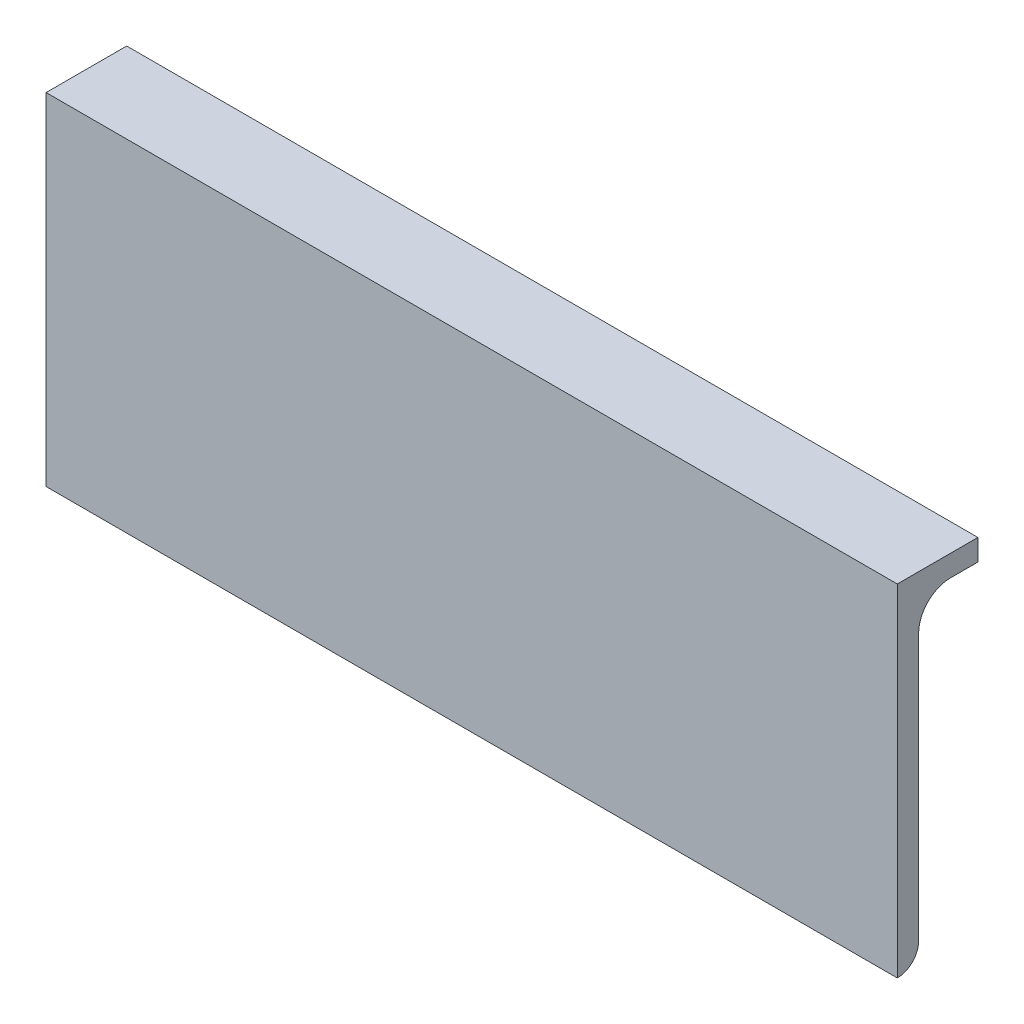
ISO-10303-21;
HEADER;
FILE_DESCRIPTION(('STEP AP214'),'2;1');
FILE_NAME('part.step','',(''),(''),'','','');
FILE_SCHEMA(('AUTOMOTIVE_DESIGN { 1 0 10303 214 1 1 1 1 }'));
ENDSEC;
DATA;
#1=APPLICATION_CONTEXT('core data for automotive mechanical design processes');
#2=APPLICATION_PROTOCOL_DEFINITION('international standard','automotive_design',2000,#1);
#3=PRODUCT_CONTEXT('',#1,'mechanical');
#4=PRODUCT('Part','Part','',(#3));
#5=PRODUCT_RELATED_PRODUCT_CATEGORY('part','',(#4));
#6=PRODUCT_DEFINITION_FORMATION('','',#4);
#7=PRODUCT_DEFINITION_CONTEXT('part definition',#1,'design');
#8=PRODUCT_DEFINITION('design','',#6,#7);
#9=PRODUCT_DEFINITION_SHAPE('','',#8);
#10=(LENGTH_UNIT() NAMED_UNIT(*) SI_UNIT(.MILLI.,.METRE.));
#11=(NAMED_UNIT(*) PLANE_ANGLE_UNIT() SI_UNIT($,.RADIAN.));
#12=(NAMED_UNIT(*) SI_UNIT($,.STERADIAN.) SOLID_ANGLE_UNIT());
#13=UNCERTAINTY_MEASURE_WITH_UNIT(LENGTH_MEASURE(1.E-05),#10,'distance_accuracy_value','');
#14=(GEOMETRIC_REPRESENTATION_CONTEXT(3) GLOBAL_UNCERTAINTY_ASSIGNED_CONTEXT((#13)) GLOBAL_UNIT_ASSIGNED_CONTEXT((#10,
#11,#12)) REPRESENTATION_CONTEXT('',''));
#15=CARTESIAN_POINT('',(0.,0.,0.));
#16=DIRECTION('',(0.,0.,1.));
#17=DIRECTION('',(1.,0.,0.));
#18=AXIS2_PLACEMENT_3D('',#15,#16,#17);
#19=CARTESIAN_POINT('',(63.36,-50.8,-3.54734504026462E-13));
#20=DIRECTION('',(0.,0.,-1.));
#21=DIRECTION('',(0.,1.,0.));
#22=AXIS2_PLACEMENT_3D('',#19,#20,#21);
#23=PLANE('',#22);
#24=DIRECTION('',(0.,-1.,0.));
#25=VECTOR('',#24,1.);
#26=CARTESIAN_POINT('',(-63.36,-50.8,-3.54734504026462E-13));
#27=LINE('',#26,#25);
#28=CARTESIAN_POINT('',(-63.36,0.,0.));
#29=VERTEX_POINT('',#28);
#30=CARTESIAN_POINT('',(-63.36,-50.8,-3.54734504026462E-13));
#31=VERTEX_POINT('',#30);
#32=EDGE_CURVE('E167',#29,#31,#27,.T.);
#33=ORIENTED_EDGE('',*,*,#32,.T.);
#34=DIRECTION('',(-1.,0.,0.));
#35=VECTOR('',#34,1.);
#36=CARTESIAN_POINT('',(63.36,-50.8,-3.54734504026462E-13));
#37=LINE('',#36,#35);
#38=CARTESIAN_POINT('',(63.36,-50.8,-3.54734504026462E-13));
#39=VERTEX_POINT('',#38);
#40=EDGE_CURVE('E13',#39,#31,#37,.T.);
#41=ORIENTED_EDGE('',*,*,#40,.F.);
#42=DIRECTION('',(0.,-1.,0.));
#43=VECTOR('',#42,1.);
#44=CARTESIAN_POINT('',(63.36,-50.8,-3.54734504026462E-13));
#45=LINE('',#44,#43);
#46=CARTESIAN_POINT('',(63.36,0.,0.));
#47=VERTEX_POINT('',#46);
#48=EDGE_CURVE('E181',#47,#39,#45,.T.);
#49=ORIENTED_EDGE('',*,*,#48,.F.);
#50=DIRECTION('',(-1.,0.,0.));
#51=VECTOR('',#50,1.);
#52=CARTESIAN_POINT('',(63.36,0.,0.));
#53=LINE('',#52,#51);
#54=EDGE_CURVE('E166',#47,#29,#53,.T.);
#55=ORIENTED_EDGE('',*,*,#54,.T.);
#56=EDGE_LOOP('',(#33,#41,#49,#55));
#57=FACE_BOUND('',#56,.T.);
#58=ADVANCED_FACE('F66',(#57),#23,.F.);
#59=CARTESIAN_POINT('',(63.36,-50.8,-0.00508000000035474));
#60=DIRECTION('',(0.,1.,0.));
#61=DIRECTION('',(-1.,0.,0.));
#62=AXIS2_PLACEMENT_3D('',#59,#60,#61);
#63=PLANE('',#62);
#64=DIRECTION('',(0.,0.,-1.));
#65=VECTOR('',#64,1.);
#66=CARTESIAN_POINT('',(-63.36,-50.8,-0.00508000000035474));
#67=LINE('',#66,#65);
#68=CARTESIAN_POINT('',(-63.36,-50.8,-0.00508000000035435));
#69=VERTEX_POINT('',#68);
#70=EDGE_CURVE('E170',#31,#69,#67,.T.);
#71=ORIENTED_EDGE('',*,*,#70,.T.);
#72=DIRECTION('',(-1.,0.,0.));
#73=VECTOR('',#72,1.);
#74=CARTESIAN_POINT('',(63.36,-50.8,-0.00508000000035435));
#75=LINE('',#74,#73);
#76=CARTESIAN_POINT('',(63.36,-50.8,-0.00508000000035435));
#77=VERTEX_POINT('',#76);
#78=EDGE_CURVE('E73',#77,#69,#75,.T.);
#79=ORIENTED_EDGE('',*,*,#78,.F.);
#80=DIRECTION('',(0.,0.,-1.));
#81=VECTOR('',#80,1.);
#82=CARTESIAN_POINT('',(63.36,-50.8,-0.00508000000035474));
#83=LINE('',#82,#81);
#84=EDGE_CURVE('E125',#39,#77,#83,.T.);
#85=ORIENTED_EDGE('',*,*,#84,.F.);
#86=ORIENTED_EDGE('',*,*,#40,.T.);
#87=EDGE_LOOP('',(#71,#79,#85,#86));
#88=FACE_BOUND('',#87,.T.);
#89=ADVANCED_FACE('F212',(#88),#63,.F.);
#90=CARTESIAN_POINT('',(63.36,-47.63008,-0.00508000000033221));
#91=DIRECTION('',(-1.,0.,0.));
#92=DIRECTION('',(0.,-1.,0.));
#93=AXIS2_PLACEMENT_3D('',#90,#91,#92);
#94=CYLINDRICAL_SURFACE('',#93,3.16992);
#95=CARTESIAN_POINT('',(-63.36,-47.63008,-0.00508000000033221));
#96=DIRECTION('',(1.,0.,0.));
#97=DIRECTION('',(0.,1.,0.));
#98=AXIS2_PLACEMENT_3D('',#95,#96,#97);
#99=CIRCLE('',#98,3.16992);
#100=CARTESIAN_POINT('',(-63.36,-47.63008,-3.17500000000033));
#101=VERTEX_POINT('',#100);
#102=EDGE_CURVE('E172',#69,#101,#99,.T.);
#103=ORIENTED_EDGE('',*,*,#102,.T.);
#104=DIRECTION('',(-1.,0.,0.));
#105=VECTOR('',#104,1.);
#106=CARTESIAN_POINT('',(63.36,-47.63008,-3.17500000000033));
#107=LINE('',#106,#105);
#108=CARTESIAN_POINT('',(63.36,-47.63008,-3.17500000000033));
#109=VERTEX_POINT('',#108);
#110=EDGE_CURVE('E154',#109,#101,#107,.T.);
#111=ORIENTED_EDGE('',*,*,#110,.F.);
#112=CARTESIAN_POINT('',(63.36,-47.63008,-0.00508000000033221));
#113=DIRECTION('',(1.,0.,0.));
#114=DIRECTION('',(0.,1.,0.));
#115=AXIS2_PLACEMENT_3D('',#112,#113,#114);
#116=CIRCLE('',#115,3.16992);
#117=EDGE_CURVE('E142',#77,#109,#116,.T.);
#118=ORIENTED_EDGE('',*,*,#117,.F.);
#119=ORIENTED_EDGE('',*,*,#78,.T.);
#120=EDGE_LOOP('',(#103,#111,#118,#119));
#121=FACE_BOUND('',#120,.T.);
#122=ADVANCED_FACE('F187',(#121),#94,.T.);
#123=CARTESIAN_POINT('',(63.36,-7.93749999999997,-3.17500000000005));
#124=DIRECTION('',(0.,0.,1.));
#125=DIRECTION('',(0.,-1.,0.));
#126=AXIS2_PLACEMENT_3D('',#123,#124,#125);
#127=PLANE('',#126);
#128=DIRECTION('',(0.,1.,0.));
#129=VECTOR('',#128,1.);
#130=CARTESIAN_POINT('',(-63.36,-7.93749999999999,-3.17500000000005));
#131=LINE('',#130,#129);
#132=CARTESIAN_POINT('',(-63.36,-7.93749999999999,-3.17500000000005));
#133=VERTEX_POINT('',#132);
#134=EDGE_CURVE('E151',#101,#133,#131,.T.);
#135=ORIENTED_EDGE('',*,*,#134,.T.);
#136=DIRECTION('',(-1.,0.,0.));
#137=VECTOR('',#136,1.);
#138=CARTESIAN_POINT('',(63.36,-7.93749999999997,-3.17500000000005));
#139=LINE('',#138,#137);
#140=CARTESIAN_POINT('',(63.36,-7.93749999999997,-3.17500000000005));
#141=VERTEX_POINT('',#140);
#142=EDGE_CURVE('E148',#141,#133,#139,.T.);
#143=ORIENTED_EDGE('',*,*,#142,.F.);
#144=DIRECTION('',(0.,1.,0.));
#145=VECTOR('',#144,1.);
#146=CARTESIAN_POINT('',(63.36,-7.93749999999997,-3.17500000000005));
#147=LINE('',#146,#145);
#148=EDGE_CURVE('E134',#109,#141,#147,.T.);
#149=ORIENTED_EDGE('',*,*,#148,.F.);
#150=ORIENTED_EDGE('',*,*,#110,.T.);
#151=EDGE_LOOP('',(#135,#143,#149,#150));
#152=FACE_BOUND('',#151,.T.);
#153=ADVANCED_FACE('F149',(#152),#127,.F.);
#154=CARTESIAN_POINT('',(63.36,-7.93749999999994,-7.93750000000005));
#155=DIRECTION('',(-1.,0.,0.));
#156=DIRECTION('',(0.,-1.,0.));
#157=AXIS2_PLACEMENT_3D('',#154,#155,#156);
#158=CYLINDRICAL_SURFACE('',#157,4.7625);
#159=CARTESIAN_POINT('',(-63.36,-7.93749999999996,-7.93750000000005));
#160=DIRECTION('',(-1.,0.,0.));
#161=DIRECTION('',(0.,-1.,0.));
#162=AXIS2_PLACEMENT_3D('',#159,#160,#161);
#163=CIRCLE('',#162,4.7625);
#164=CARTESIAN_POINT('',(-63.36,-3.17499999999996,-7.93750000000002));
#165=VERTEX_POINT('',#164);
#166=EDGE_CURVE('E175',#133,#165,#163,.T.);
#167=ORIENTED_EDGE('',*,*,#166,.T.);
#168=DIRECTION('',(-1.,0.,0.));
#169=VECTOR('',#168,1.);
#170=CARTESIAN_POINT('',(63.36,-3.17499999999994,-7.93750000000002));
#171=LINE('',#170,#169);
#172=CARTESIAN_POINT('',(63.36,-3.17499999999994,-7.93750000000002));
#173=VERTEX_POINT('',#172);
#174=EDGE_CURVE('E155',#173,#165,#171,.T.);
#175=ORIENTED_EDGE('',*,*,#174,.F.);
#176=CARTESIAN_POINT('',(63.36,-7.93749999999994,-7.93750000000005));
#177=DIRECTION('',(-1.,0.,0.));
#178=DIRECTION('',(0.,-1.,0.));
#179=AXIS2_PLACEMENT_3D('',#176,#177,#178);
#180=CIRCLE('',#179,4.7625);
#181=EDGE_CURVE('E139',#141,#173,#180,.T.);
#182=ORIENTED_EDGE('',*,*,#181,.F.);
#183=ORIENTED_EDGE('',*,*,#142,.T.);
#184=EDGE_LOOP('',(#167,#175,#182,#183));
#185=FACE_BOUND('',#184,.T.);
#186=ADVANCED_FACE('F157',(#185),#158,.F.);
#187=CARTESIAN_POINT('',(63.36,-3.17499999999964,-47.63008));
#188=DIRECTION('',(0.,1.,0.));
#189=DIRECTION('',(0.,0.,1.));
#190=AXIS2_PLACEMENT_3D('',#187,#188,#189);
#191=PLANE('',#190);
#192=DIRECTION('',(0.,0.,-1.));
#193=VECTOR('',#192,1.);
#194=CARTESIAN_POINT('',(-63.36,-3.17499999999967,-47.63008));
#195=LINE('',#194,#193);
#196=CARTESIAN_POINT('',(-63.36,-3.17499999999993,-12.));
#197=VERTEX_POINT('',#196);
#198=EDGE_CURVE('E177',#165,#197,#195,.T.);
#199=ORIENTED_EDGE('',*,*,#198,.T.);
#200=DIRECTION('',(-1.,0.,0.));
#201=VECTOR('',#200,1.);
#202=CARTESIAN_POINT('',(63.36,-3.1749999999999,-12.));
#203=LINE('',#202,#201);
#204=CARTESIAN_POINT('',(63.36,-3.1749999999999,-12.));
#205=VERTEX_POINT('',#204);
#206=EDGE_CURVE('E80',#205,#197,#203,.T.);
#207=ORIENTED_EDGE('',*,*,#206,.F.);
#208=DIRECTION('',(0.,0.,-1.));
#209=VECTOR('',#208,1.);
#210=CARTESIAN_POINT('',(63.36,-3.17499999999964,-47.63008));
#211=LINE('',#210,#209);
#212=EDGE_CURVE('E160',#173,#205,#211,.T.);
#213=ORIENTED_EDGE('',*,*,#212,.F.);
#214=ORIENTED_EDGE('',*,*,#174,.T.);
#215=EDGE_LOOP('',(#199,#207,#213,#214));
#216=FACE_BOUND('',#215,.T.);
#217=ADVANCED_FACE('F193',(#216),#191,.F.);
#218=CARTESIAN_POINT('',(63.36,0.,0.));
#219=DIRECTION('',(0.,-1.,0.));
#220=DIRECTION('',(0.,0.,-1.));
#221=AXIS2_PLACEMENT_3D('',#218,#219,#220);
#222=PLANE('',#221);
#223=DIRECTION('',(0.,0.,1.));
#224=VECTOR('',#223,1.);
#225=CARTESIAN_POINT('',(63.36,0.,0.));
#226=LINE('',#225,#224);
#227=CARTESIAN_POINT('',(63.36,0.,-12.));
#228=VERTEX_POINT('',#227);
#229=EDGE_CURVE('E89',#228,#47,#226,.T.);
#230=ORIENTED_EDGE('',*,*,#229,.F.);
#231=DIRECTION('',(1.,0.,0.));
#232=VECTOR('',#231,1.);
#233=CARTESIAN_POINT('',(63.36,0.,-12.));
#234=LINE('',#233,#232);
#235=CARTESIAN_POINT('',(-63.36,0.,-12.));
#236=VERTEX_POINT('',#235);
#237=EDGE_CURVE('E198',#236,#228,#234,.T.);
#238=ORIENTED_EDGE('',*,*,#237,.F.);
#239=DIRECTION('',(0.,0.,1.));
#240=VECTOR('',#239,1.);
#241=CARTESIAN_POINT('',(-63.36,0.,0.));
#242=LINE('',#241,#240);
#243=EDGE_CURVE('E117',#236,#29,#242,.T.);
#244=ORIENTED_EDGE('',*,*,#243,.T.);
#245=ORIENTED_EDGE('',*,*,#54,.F.);
#246=EDGE_LOOP('',(#230,#238,#244,#245));
#247=FACE_BOUND('',#246,.T.);
#248=ADVANCED_FACE('F203',(#247),#222,.F.);
#249=CARTESIAN_POINT('',(63.36,-0.00507999999964432,-47.63008));
#250=DIRECTION('',(-1.,0.,0.));
#251=DIRECTION('',(0.,-1.,0.));
#252=AXIS2_PLACEMENT_3D('',#249,#250,#251);
#253=PLANE('',#252);
#254=ORIENTED_EDGE('',*,*,#212,.T.);
#255=DIRECTION('',(0.,1.,0.));
#256=VECTOR('',#255,1.);
#257=CARTESIAN_POINT('',(63.36,-135.701972349028,-12.0000000000009));
#258=LINE('',#257,#256);
#259=EDGE_CURVE('E195',#205,#228,#258,.T.);
#260=ORIENTED_EDGE('',*,*,#259,.T.);
#261=ORIENTED_EDGE('',*,*,#229,.T.);
#262=ORIENTED_EDGE('',*,*,#48,.T.);
#263=ORIENTED_EDGE('',*,*,#84,.T.);
#264=ORIENTED_EDGE('',*,*,#117,.T.);
#265=ORIENTED_EDGE('',*,*,#148,.T.);
#266=ORIENTED_EDGE('',*,*,#181,.T.);
#267=EDGE_LOOP('',(#254,#260,#261,#262,#263,#264,#265,#266));
#268=FACE_BOUND('',#267,.T.);
#269=ADVANCED_FACE('F137',(#268),#253,.F.);
#270=CARTESIAN_POINT('',(-63.36,-0.0050799999996676,-47.63008));
#271=DIRECTION('',(-1.,0.,0.));
#272=DIRECTION('',(0.,-1.,0.));
#273=AXIS2_PLACEMENT_3D('',#270,#271,#272);
#274=PLANE('',#273);
#275=DIRECTION('',(0.,1.,0.));
#276=VECTOR('',#275,1.);
#277=CARTESIAN_POINT('',(-63.36,-135.701972349028,-12.0000000000009));
#278=LINE('',#277,#276);
#279=EDGE_CURVE('E200',#197,#236,#278,.T.);
#280=ORIENTED_EDGE('',*,*,#279,.F.);
#281=ORIENTED_EDGE('',*,*,#198,.F.);
#282=ORIENTED_EDGE('',*,*,#166,.F.);
#283=ORIENTED_EDGE('',*,*,#134,.F.);
#284=ORIENTED_EDGE('',*,*,#102,.F.);
#285=ORIENTED_EDGE('',*,*,#70,.F.);
#286=ORIENTED_EDGE('',*,*,#32,.F.);
#287=ORIENTED_EDGE('',*,*,#243,.F.);
#288=EDGE_LOOP('',(#280,#281,#282,#283,#284,#285,#286,#287));
#289=FACE_BOUND('',#288,.T.);
#290=ADVANCED_FACE('F189',(#289),#274,.T.);
#291=CARTESIAN_POINT('',(63.36,-135.701972349028,-12.0000000000009));
#292=DIRECTION('',(0.,0.,1.));
#293=DIRECTION('',(0.,-1.,0.));
#294=AXIS2_PLACEMENT_3D('',#291,#292,#293);
#295=PLANE('',#294);
#296=ORIENTED_EDGE('',*,*,#206,.T.);
#297=ORIENTED_EDGE('',*,*,#279,.T.);
#298=ORIENTED_EDGE('',*,*,#237,.T.);
#299=ORIENTED_EDGE('',*,*,#259,.F.);
#300=EDGE_LOOP('',(#296,#297,#298,#299));
#301=FACE_BOUND('',#300,.T.);
#302=ADVANCED_FACE('F201',(#301),#295,.F.);
#303=CLOSED_SHELL('',(#58,#89,#122,#153,#186,#217,#248,#269,#290,#302));
#304=MANIFOLD_SOLID_BREP('B2',#303);
#305=ADVANCED_BREP_SHAPE_REPRESENTATION('',(#18,#304),#14);
#306=SHAPE_DEFINITION_REPRESENTATION(#9,#305);
ENDSEC;
END-ISO-10303-21;
